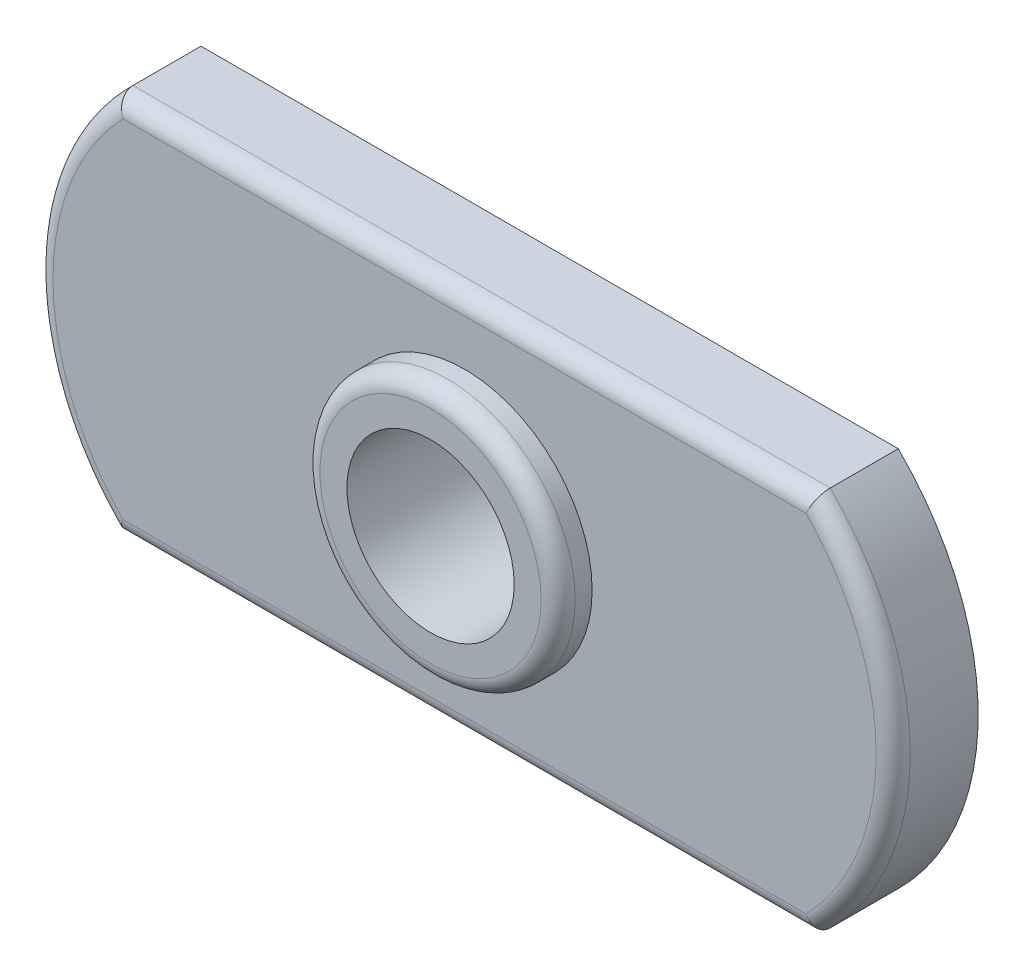
ISO-10303-21;
HEADER;
FILE_DESCRIPTION(('STEP AP214'),'2;1');
FILE_NAME('part.step','',(''),(''),'','','');
FILE_SCHEMA(('AUTOMOTIVE_DESIGN { 1 0 10303 214 1 1 1 1 }'));
ENDSEC;
DATA;
#1=APPLICATION_CONTEXT('core data for automotive mechanical design processes');
#2=APPLICATION_PROTOCOL_DEFINITION('international standard','automotive_design',2000,#1);
#3=PRODUCT_CONTEXT('',#1,'mechanical');
#4=PRODUCT('Part','Part','',(#3));
#5=PRODUCT_RELATED_PRODUCT_CATEGORY('part','',(#4));
#6=PRODUCT_DEFINITION_FORMATION('','',#4);
#7=PRODUCT_DEFINITION_CONTEXT('part definition',#1,'design');
#8=PRODUCT_DEFINITION('design','',#6,#7);
#9=PRODUCT_DEFINITION_SHAPE('','',#8);
#10=(LENGTH_UNIT() NAMED_UNIT(*) SI_UNIT(.MILLI.,.METRE.));
#11=(NAMED_UNIT(*) PLANE_ANGLE_UNIT() SI_UNIT($,.RADIAN.));
#12=(NAMED_UNIT(*) SI_UNIT($,.STERADIAN.) SOLID_ANGLE_UNIT());
#13=UNCERTAINTY_MEASURE_WITH_UNIT(LENGTH_MEASURE(1.E-05),#10,'distance_accuracy_value','');
#14=(GEOMETRIC_REPRESENTATION_CONTEXT(3) GLOBAL_UNCERTAINTY_ASSIGNED_CONTEXT((#13)) GLOBAL_UNIT_ASSIGNED_CONTEXT((#10,
#11,#12)) REPRESENTATION_CONTEXT('',''));
#15=CARTESIAN_POINT('',(0.,0.,0.));
#16=DIRECTION('',(0.,0.,1.));
#17=DIRECTION('',(1.,0.,0.));
#18=AXIS2_PLACEMENT_3D('',#15,#16,#17);
#19=CARTESIAN_POINT('',(-4.75265957446808,0.,2.5));
#20=DIRECTION('',(0.,0.,1.));
#21=DIRECTION('',(1.,0.,0.));
#22=AXIS2_PLACEMENT_3D('',#19,#20,#21);
#23=PLANE('',#22);
#24=DIRECTION('',(-1.,0.,0.));
#25=VECTOR('',#24,1.);
#26=CARTESIAN_POINT('',(-10.25,5.1,2.5));
#27=LINE('',#26,#25);
#28=CARTESIAN_POINT('',(10.0416492065865,5.09999999999999,2.5));
#29=VERTEX_POINT('',#28);
#30=CARTESIAN_POINT('',(-10.0416492065865,5.1,2.5));
#31=VERTEX_POINT('',#30);
#32=EDGE_CURVE('E139',#29,#31,#27,.T.);
#33=ORIENTED_EDGE('',*,*,#32,.T.);
#34=CARTESIAN_POINT('',(-4.75265957446808,0.,2.5));
#35=DIRECTION('',(0.,0.,1.));
#36=DIRECTION('',(1.,0.,0.));
#37=AXIS2_PLACEMENT_3D('',#34,#35,#36);
#38=CIRCLE('',#37,7.34734042553192);
#39=CARTESIAN_POINT('',(-10.0416492065865,-5.1,2.5));
#40=VERTEX_POINT('',#39);
#41=EDGE_CURVE('E141',#31,#40,#38,.T.);
#42=ORIENTED_EDGE('',*,*,#41,.T.);
#43=DIRECTION('',(1.,0.,0.));
#44=VECTOR('',#43,1.);
#45=CARTESIAN_POINT('',(10.25,-5.1,2.5));
#46=LINE('',#45,#44);
#47=CARTESIAN_POINT('',(10.0416492065865,-5.1,2.5));
#48=VERTEX_POINT('',#47);
#49=EDGE_CURVE('E108',#40,#48,#46,.T.);
#50=ORIENTED_EDGE('',*,*,#49,.T.);
#51=CARTESIAN_POINT('',(4.75265957446808,0.,2.5));
#52=DIRECTION('',(0.,0.,1.));
#53=DIRECTION('',(1.,0.,0.));
#54=AXIS2_PLACEMENT_3D('',#51,#52,#53);
#55=CIRCLE('',#54,7.34734042553192);
#56=EDGE_CURVE('E137',#48,#29,#55,.T.);
#57=ORIENTED_EDGE('',*,*,#56,.T.);
#58=EDGE_LOOP('',(#33,#42,#50,#57));
#59=FACE_BOUND('',#58,.T.);
#60=CARTESIAN_POINT('',(0.,0.,2.5));
#61=DIRECTION('',(0.,0.,1.));
#62=DIRECTION('',(1.,0.,0.));
#63=AXIS2_PLACEMENT_3D('',#60,#61,#62);
#64=CIRCLE('',#63,3.75);
#65=CARTESIAN_POINT('',(3.75,0.,2.5));
#66=VERTEX_POINT('',#65);
#67=EDGE_CURVE('E122',#66,#66,#64,.T.);
#68=ORIENTED_EDGE('',*,*,#67,.F.);
#69=EDGE_LOOP('',(#68));
#70=FACE_BOUND('',#69,.T.);
#71=ADVANCED_FACE('F37',(#59,#70),#23,.T.);
#72=CARTESIAN_POINT('',(-4.75265957446808,0.,2.5));
#73=DIRECTION('',(0.,0.,-1.));
#74=DIRECTION('',(-1.,0.,0.));
#75=AXIS2_PLACEMENT_3D('',#72,#73,#74);
#76=CYLINDRICAL_SURFACE('',#75,7.84734042553192);
#77=DIRECTION('',(0.,0.,-1.));
#78=VECTOR('',#77,1.);
#79=CARTESIAN_POINT('',(-10.25,-5.6,2.5));
#80=LINE('',#79,#78);
#81=CARTESIAN_POINT('',(-10.25,-5.6,2.));
#82=VERTEX_POINT('',#81);
#83=CARTESIAN_POINT('',(-10.25,-5.6,0.));
#84=VERTEX_POINT('',#83);
#85=EDGE_CURVE('E97',#82,#84,#80,.T.);
#86=ORIENTED_EDGE('',*,*,#85,.F.);
#87=CARTESIAN_POINT('',(-4.75265957446808,0.,2.));
#88=DIRECTION('',(0.,0.,1.));
#89=DIRECTION('',(1.,0.,0.));
#90=AXIS2_PLACEMENT_3D('',#87,#88,#89);
#91=CIRCLE('',#90,7.84734042553192);
#92=CARTESIAN_POINT('',(-10.25,5.6,2.));
#93=VERTEX_POINT('',#92);
#94=EDGE_CURVE('E144',#82,#93,#91,.F.);
#95=ORIENTED_EDGE('',*,*,#94,.T.);
#96=DIRECTION('',(0.,0.,-1.));
#97=VECTOR('',#96,1.);
#98=CARTESIAN_POINT('',(-10.25,5.6,2.5));
#99=LINE('',#98,#97);
#100=CARTESIAN_POINT('',(-10.25,5.6,0.));
#101=VERTEX_POINT('',#100);
#102=EDGE_CURVE('E120',#93,#101,#99,.T.);
#103=ORIENTED_EDGE('',*,*,#102,.T.);
#104=CARTESIAN_POINT('',(-4.75265957446808,0.,0.));
#105=DIRECTION('',(0.,0.,1.));
#106=DIRECTION('',(1.,0.,0.));
#107=AXIS2_PLACEMENT_3D('',#104,#105,#106);
#108=CIRCLE('',#107,7.84734042553192);
#109=EDGE_CURVE('E115',#101,#84,#108,.T.);
#110=ORIENTED_EDGE('',*,*,#109,.T.);
#111=EDGE_LOOP('',(#86,#95,#103,#110));
#112=FACE_BOUND('',#111,.T.);
#113=ADVANCED_FACE('F119',(#112),#76,.T.);
#114=CARTESIAN_POINT('',(-10.25,-5.6,2.5));
#115=DIRECTION('',(0.,1.,0.));
#116=DIRECTION('',(-1.,0.,0.));
#117=AXIS2_PLACEMENT_3D('',#114,#115,#116);
#118=PLANE('',#117);
#119=DIRECTION('',(0.,0.,-1.));
#120=VECTOR('',#119,1.);
#121=CARTESIAN_POINT('',(10.25,-5.6,2.5));
#122=LINE('',#121,#120);
#123=CARTESIAN_POINT('',(10.25,-5.6,2.));
#124=VERTEX_POINT('',#123);
#125=CARTESIAN_POINT('',(10.25,-5.6,0.));
#126=VERTEX_POINT('',#125);
#127=EDGE_CURVE('E109',#124,#126,#122,.T.);
#128=ORIENTED_EDGE('',*,*,#127,.F.);
#129=DIRECTION('',(1.,0.,0.));
#130=VECTOR('',#129,1.);
#131=CARTESIAN_POINT('',(-10.25,-5.6,2.));
#132=LINE('',#131,#130);
#133=EDGE_CURVE('E103',#124,#82,#132,.F.);
#134=ORIENTED_EDGE('',*,*,#133,.T.);
#135=ORIENTED_EDGE('',*,*,#85,.T.);
#136=DIRECTION('',(1.,0.,0.));
#137=VECTOR('',#136,1.);
#138=CARTESIAN_POINT('',(-10.25,-5.6,0.));
#139=LINE('',#138,#137);
#140=EDGE_CURVE('E100',#84,#126,#139,.T.);
#141=ORIENTED_EDGE('',*,*,#140,.T.);
#142=EDGE_LOOP('',(#128,#134,#135,#141));
#143=FACE_BOUND('',#142,.T.);
#144=ADVANCED_FACE('F99',(#143),#118,.F.);
#145=CARTESIAN_POINT('',(4.75265957446808,0.,2.5));
#146=DIRECTION('',(0.,0.,-1.));
#147=DIRECTION('',(-1.,0.,0.));
#148=AXIS2_PLACEMENT_3D('',#145,#146,#147);
#149=CYLINDRICAL_SURFACE('',#148,7.84734042553192);
#150=DIRECTION('',(0.,0.,-1.));
#151=VECTOR('',#150,1.);
#152=CARTESIAN_POINT('',(10.25,5.6,2.5));
#153=LINE('',#152,#151);
#154=CARTESIAN_POINT('',(10.25,5.6,2.));
#155=VERTEX_POINT('',#154);
#156=CARTESIAN_POINT('',(10.25,5.6,0.));
#157=VERTEX_POINT('',#156);
#158=EDGE_CURVE('E133',#155,#157,#153,.T.);
#159=ORIENTED_EDGE('',*,*,#158,.F.);
#160=CARTESIAN_POINT('',(4.75265957446808,0.,2.));
#161=DIRECTION('',(0.,0.,1.));
#162=DIRECTION('',(1.,0.,0.));
#163=AXIS2_PLACEMENT_3D('',#160,#161,#162);
#164=CIRCLE('',#163,7.84734042553192);
#165=EDGE_CURVE('E58',#155,#124,#164,.F.);
#166=ORIENTED_EDGE('',*,*,#165,.T.);
#167=ORIENTED_EDGE('',*,*,#127,.T.);
#168=CARTESIAN_POINT('',(4.75265957446808,0.,0.));
#169=DIRECTION('',(0.,0.,1.));
#170=DIRECTION('',(1.,0.,0.));
#171=AXIS2_PLACEMENT_3D('',#168,#169,#170);
#172=CIRCLE('',#171,7.84734042553192);
#173=EDGE_CURVE('E117',#126,#157,#172,.T.);
#174=ORIENTED_EDGE('',*,*,#173,.T.);
#175=EDGE_LOOP('',(#159,#166,#167,#174));
#176=FACE_BOUND('',#175,.T.);
#177=ADVANCED_FACE('F209',(#176),#149,.T.);
#178=CARTESIAN_POINT('',(10.25,5.6,2.5));
#179=DIRECTION('',(0.,-1.,0.));
#180=DIRECTION('',(1.,0.,0.));
#181=AXIS2_PLACEMENT_3D('',#178,#179,#180);
#182=PLANE('',#181);
#183=ORIENTED_EDGE('',*,*,#102,.F.);
#184=DIRECTION('',(-1.,0.,0.));
#185=VECTOR('',#184,1.);
#186=CARTESIAN_POINT('',(10.25,5.6,2.));
#187=LINE('',#186,#185);
#188=EDGE_CURVE('E66',#93,#155,#187,.F.);
#189=ORIENTED_EDGE('',*,*,#188,.T.);
#190=ORIENTED_EDGE('',*,*,#158,.T.);
#191=DIRECTION('',(-1.,0.,0.));
#192=VECTOR('',#191,1.);
#193=CARTESIAN_POINT('',(10.25,5.6,0.));
#194=LINE('',#193,#192);
#195=EDGE_CURVE('E130',#157,#101,#194,.T.);
#196=ORIENTED_EDGE('',*,*,#195,.T.);
#197=EDGE_LOOP('',(#183,#189,#190,#196));
#198=FACE_BOUND('',#197,.T.);
#199=ADVANCED_FACE('F205',(#198),#182,.F.);
#200=CARTESIAN_POINT('',(-4.75265957446808,0.,0.));
#201=DIRECTION('',(0.,0.,1.));
#202=DIRECTION('',(1.,0.,0.));
#203=AXIS2_PLACEMENT_3D('',#200,#201,#202);
#204=PLANE('',#203);
#205=CARTESIAN_POINT('',(0.,0.,0.));
#206=DIRECTION('',(0.,0.,1.));
#207=DIRECTION('',(1.,0.,0.));
#208=AXIS2_PLACEMENT_3D('',#205,#206,#207);
#209=CIRCLE('',#208,2.45850000000001);
#210=CARTESIAN_POINT('',(2.45850000000001,0.,0.));
#211=VERTEX_POINT('',#210);
#212=EDGE_CURVE('E125',#211,#211,#209,.T.);
#213=ORIENTED_EDGE('',*,*,#212,.T.);
#214=EDGE_LOOP('',(#213));
#215=FACE_BOUND('',#214,.T.);
#216=ORIENTED_EDGE('',*,*,#109,.F.);
#217=ORIENTED_EDGE('',*,*,#195,.F.);
#218=ORIENTED_EDGE('',*,*,#173,.F.);
#219=ORIENTED_EDGE('',*,*,#140,.F.);
#220=EDGE_LOOP('',(#216,#217,#218,#219));
#221=FACE_BOUND('',#220,.T.);
#222=ADVANCED_FACE('F113',(#215,#221),#204,.F.);
#223=CARTESIAN_POINT('',(0.,0.,3.5));
#224=DIRECTION('',(0.,0.,-1.));
#225=DIRECTION('',(-1.,0.,0.));
#226=AXIS2_PLACEMENT_3D('',#223,#224,#225);
#227=CYLINDRICAL_SURFACE('',#226,3.75);
#228=CARTESIAN_POINT('',(0.,0.,3.));
#229=DIRECTION('',(0.,0.,1.));
#230=DIRECTION('',(1.,0.,0.));
#231=AXIS2_PLACEMENT_3D('',#228,#229,#230);
#232=CIRCLE('',#231,3.75);
#233=CARTESIAN_POINT('',(3.75,0.,3.));
#234=VERTEX_POINT('',#233);
#235=EDGE_CURVE('E11',#234,#234,#232,.F.);
#236=ORIENTED_EDGE('',*,*,#235,.T.);
#237=EDGE_LOOP('',(#236));
#238=FACE_BOUND('',#237,.T.);
#239=ORIENTED_EDGE('',*,*,#67,.T.);
#240=EDGE_LOOP('',(#239));
#241=FACE_BOUND('',#240,.T.);
#242=ADVANCED_FACE('F201',(#238,#241),#227,.T.);
#243=CARTESIAN_POINT('',(0.,0.,3.5));
#244=DIRECTION('',(0.,0.,1.));
#245=DIRECTION('',(1.,0.,0.));
#246=AXIS2_PLACEMENT_3D('',#243,#244,#245);
#247=PLANE('',#246);
#248=CARTESIAN_POINT('',(0.,0.,3.5));
#249=DIRECTION('',(0.,0.,1.));
#250=DIRECTION('',(1.,0.,0.));
#251=AXIS2_PLACEMENT_3D('',#248,#249,#250);
#252=CIRCLE('',#251,3.25);
#253=CARTESIAN_POINT('',(3.25,0.,3.5));
#254=VERTEX_POINT('',#253);
#255=EDGE_CURVE('E50',#254,#254,#252,.T.);
#256=ORIENTED_EDGE('',*,*,#255,.T.);
#257=EDGE_LOOP('',(#256));
#258=FACE_BOUND('',#257,.T.);
#259=CARTESIAN_POINT('',(0.,0.,3.5));
#260=DIRECTION('',(0.,0.,1.));
#261=DIRECTION('',(1.,0.,0.));
#262=AXIS2_PLACEMENT_3D('',#259,#260,#261);
#263=CIRCLE('',#262,2.45850000000001);
#264=CARTESIAN_POINT('',(2.45850000000001,0.,3.5));
#265=VERTEX_POINT('',#264);
#266=EDGE_CURVE('E311',#265,#265,#263,.T.);
#267=ORIENTED_EDGE('',*,*,#266,.F.);
#268=EDGE_LOOP('',(#267));
#269=FACE_BOUND('',#268,.T.);
#270=ADVANCED_FACE('F188',(#258,#269),#247,.T.);
#271=CARTESIAN_POINT('',(0.,0.,3.5));
#272=DIRECTION('',(0.,0.,1.));
#273=DIRECTION('',(1.,0.,0.));
#274=AXIS2_PLACEMENT_3D('',#271,#272,#273);
#275=CYLINDRICAL_SURFACE('',#274,2.45850000000001);
#276=ORIENTED_EDGE('',*,*,#212,.F.);
#277=EDGE_LOOP('',(#276));
#278=FACE_BOUND('',#277,.T.);
#279=ORIENTED_EDGE('',*,*,#266,.T.);
#280=EDGE_LOOP('',(#279));
#281=FACE_BOUND('',#280,.T.);
#282=ADVANCED_FACE('F180',(#278,#281),#275,.F.);
#283=CARTESIAN_POINT('',(4.75265957446808,0.,2.));
#284=DIRECTION('',(0.,0.,1.));
#285=DIRECTION('',(1.,0.,0.));
#286=AXIS2_PLACEMENT_3D('',#283,#284,#285);
#287=TOROIDAL_SURFACE('',#286,7.34734042553192,0.5);
#288=CARTESIAN_POINT('',(10.25,-5.6,2.));
#289=CARTESIAN_POINT('',(10.250011402791,-5.60002984456552,2.0266115029985));
#290=CARTESIAN_POINT('',(10.2491323230388,-5.59787754354878,2.05320410315333));
#291=CARTESIAN_POINT('',(10.2456826291113,-5.5894420215127,2.10554137407861));
#292=CARTESIAN_POINT('',(10.2431166303748,-5.58317007196215,2.13128815777437));
#293=CARTESIAN_POINT('',(10.2363824451846,-5.56672826674952,2.18127086868435));
#294=CARTESIAN_POINT('',(10.2322146337897,-5.55655932355669,2.20550714803526));
#295=CARTESIAN_POINT('',(10.2224260199008,-5.53271361496976,2.25186976520071));
#296=CARTESIAN_POINT('',(10.2168047118143,-5.51903562898359,2.27399536515132));
#297=CARTESIAN_POINT('',(10.2041004813723,-5.48818223477534,2.31625875487421));
#298=CARTESIAN_POINT('',(10.1969788729479,-5.47091445972466,2.33631730122969));
#299=CARTESIAN_POINT('',(10.1815981164705,-5.43370628653791,2.37326680529309));
#300=CARTESIAN_POINT('',(10.1733386020651,-5.41376502772066,2.39015673870281));
#301=CARTESIAN_POINT('',(10.1552867876469,-5.37029338260402,2.42155695040794));
#302=CARTESIAN_POINT('',(10.1454274573574,-5.34660903206974,2.43581524720428));
#303=CARTESIAN_POINT('',(10.1249214951466,-5.29749606565613,2.46015945235529));
#304=CARTESIAN_POINT('',(10.1142746021899,-5.27206687165739,2.47024396995244));
#305=CARTESIAN_POINT('',(10.0937092563895,-5.22310259202681,2.48520589127507));
#306=CARTESIAN_POINT('',(10.0838466233048,-5.19968319303782,2.49054669221443));
#307=CARTESIAN_POINT('',(10.0638987840409,-5.15245122932119,2.49781312217656));
#308=CARTESIAN_POINT('',(10.0538140501624,-5.12863952176762,2.4997454006235));
#309=CARTESIAN_POINT('',(10.0430232792986,-5.10323411585027,2.49999217263718));
#310=CARTESIAN_POINT('',(10.0423362711842,-5.10161696539383,2.5000000185035));
#311=CARTESIAN_POINT('',(10.0416492065864,-5.1,2.5));
#312=B_SPLINE_CURVE_WITH_KNOTS('',3,(#288,#289,#290,#291,#292,#293,#294,#295,#296,#297,#298,
#299,#300,#301,#302,#303,#304,#305,#306,#307,#308,#309,#310,#311),.UNSPECIFIED.,.F.,.F.,(4,2,2,
2,2,2,2,2,2,2,2,4),(0.,0.0797038566524749,0.159190544737728,0.238658632615913,0.318154400391605,
0.400027749102196,0.481927519076945,0.569605842672987,0.657313358351373,0.734996715675133,
0.812528358218248,0.817799419336087),.UNSPECIFIED.);
#313=EDGE_CURVE('E172',#124,#48,#312,.T.);
#314=ORIENTED_EDGE('',*,*,#313,.F.);
#315=ORIENTED_EDGE('',*,*,#165,.F.);
#316=CARTESIAN_POINT('',(10.25,5.6,2.));
#317=CARTESIAN_POINT('',(10.250011402791,5.60002984456552,2.0266115029985));
#318=CARTESIAN_POINT('',(10.2491323230388,5.59787754354878,2.05320410315333));
#319=CARTESIAN_POINT('',(10.2456826291113,5.5894420215127,2.10554137407861));
#320=CARTESIAN_POINT('',(10.2431166303748,5.58317007196215,2.13128815777437));
#321=CARTESIAN_POINT('',(10.2363824451846,5.56672826674951,2.18127086868435));
#322=CARTESIAN_POINT('',(10.2322146337898,5.55655932355669,2.20550714803526));
#323=CARTESIAN_POINT('',(10.2224260199008,5.53271361496975,2.25186976520071));
#324=CARTESIAN_POINT('',(10.2168047118144,5.51903562898358,2.27399536515132));
#325=CARTESIAN_POINT('',(10.2041004813723,5.48818223477533,2.31625875487421));
#326=CARTESIAN_POINT('',(10.1969788729479,5.47091445972466,2.33631730122969));
#327=CARTESIAN_POINT('',(10.1815981164705,5.43370628653791,2.37326680529309));
#328=CARTESIAN_POINT('',(10.1733386020651,5.41376502772066,2.39015673870281));
#329=CARTESIAN_POINT('',(10.1552867876469,5.37029338260402,2.42155695040794));
#330=CARTESIAN_POINT('',(10.1454274573574,5.34660903206973,2.43581524720428));
#331=CARTESIAN_POINT('',(10.1249214951466,5.29749606565613,2.46015945235529));
#332=CARTESIAN_POINT('',(10.1142746021899,5.27206687165739,2.47024396995244));
#333=CARTESIAN_POINT('',(10.0937092563895,5.2231025920268,2.48520589127507));
#334=CARTESIAN_POINT('',(10.0838466233048,5.19968319303782,2.49054669221443));
#335=CARTESIAN_POINT('',(10.0638987840409,5.15245122932119,2.49781312217656));
#336=CARTESIAN_POINT('',(10.0538140501624,5.12863952176761,2.4997454006235));
#337=CARTESIAN_POINT('',(10.0430232792986,5.10323411585026,2.49999217263718));
#338=CARTESIAN_POINT('',(10.0423362711842,5.10161696539383,2.5000000185035));
#339=CARTESIAN_POINT('',(10.0416492065864,5.1,2.5));
#340=B_SPLINE_CURVE_WITH_KNOTS('',3,(#316,#317,#318,#319,#320,#321,#322,#323,#324,#325,#326,
#327,#328,#329,#330,#331,#332,#333,#334,#335,#336,#337,#338,#339),.UNSPECIFIED.,.F.,.F.,(4,2,2,
2,2,2,2,2,2,2,2,4),(0.,0.0797038566524743,0.159190544737727,0.238658632615913,0.318154400391605,
0.400027749102196,0.481927519076945,0.569605842672987,0.657313358351372,0.734996715675132,
0.812528358218248,0.817799419336088),.UNSPECIFIED.);
#341=EDGE_CURVE('E41',#29,#155,#340,.F.);
#342=ORIENTED_EDGE('',*,*,#341,.F.);
#343=ORIENTED_EDGE('',*,*,#56,.F.);
#344=EDGE_LOOP('',(#314,#315,#342,#343));
#345=FACE_BOUND('',#344,.T.);
#346=ADVANCED_FACE('F177',(#345),#287,.T.);
#347=CARTESIAN_POINT('',(-4.75265957446808,5.1,2.));
#348=DIRECTION('',(1.,0.,0.));
#349=DIRECTION('',(0.,1.,0.));
#350=AXIS2_PLACEMENT_3D('',#347,#348,#349);
#351=CYLINDRICAL_SURFACE('',#350,0.5);
#352=ORIENTED_EDGE('',*,*,#341,.T.);
#353=ORIENTED_EDGE('',*,*,#188,.F.);
#354=CARTESIAN_POINT('',(-10.25,5.6,2.));
#355=CARTESIAN_POINT('',(-10.250011402791,5.60002984456552,2.0266115029985));
#356=CARTESIAN_POINT('',(-10.2491323230388,5.59787754354878,2.05320410315333));
#357=CARTESIAN_POINT('',(-10.2456826291113,5.5894420215127,2.10554137407861));
#358=CARTESIAN_POINT('',(-10.2431166303748,5.58317007196216,2.13128815777437));
#359=CARTESIAN_POINT('',(-10.2363824451846,5.56672826674952,2.18127086868435));
#360=CARTESIAN_POINT('',(-10.2322146337897,5.5565593235567,2.20550714803526));
#361=CARTESIAN_POINT('',(-10.2224260199008,5.53271361496976,2.25186976520071));
#362=CARTESIAN_POINT('',(-10.2168047118143,5.51903562898359,2.27399536515132));
#363=CARTESIAN_POINT('',(-10.2041004813723,5.48818223477534,2.31625875487421));
#364=CARTESIAN_POINT('',(-10.1969788729479,5.47091445972467,2.33631730122969));
#365=CARTESIAN_POINT('',(-10.1815981164705,5.43370628653791,2.37326680529309));
#366=CARTESIAN_POINT('',(-10.1733386020651,5.41376502772066,2.39015673870281));
#367=CARTESIAN_POINT('',(-10.1552867876469,5.37029338260402,2.42155695040794));
#368=CARTESIAN_POINT('',(-10.1454274573574,5.34660903206974,2.43581524720428));
#369=CARTESIAN_POINT('',(-10.1249214951466,5.29749606565613,2.46015945235529));
#370=CARTESIAN_POINT('',(-10.1142746021899,5.2720668716574,2.47024396995244));
#371=CARTESIAN_POINT('',(-10.0937092563895,5.22310259202681,2.48520589127507));
#372=CARTESIAN_POINT('',(-10.0838466233048,5.19968319303783,2.49054669221443));
#373=CARTESIAN_POINT('',(-10.0638987840409,5.15245122932119,2.49781312217656));
#374=CARTESIAN_POINT('',(-10.0538140501624,5.1286395217676,2.4997454006235));
#375=CARTESIAN_POINT('',(-10.0430232792986,5.10323411585027,2.49999217263718));
#376=CARTESIAN_POINT('',(-10.0423362711842,5.10161696539383,2.5000000185035));
#377=CARTESIAN_POINT('',(-10.0416492065864,5.1,2.5));
#378=B_SPLINE_CURVE_WITH_KNOTS('',3,(#354,#355,#356,#357,#358,#359,#360,#361,#362,#363,#364,
#365,#366,#367,#368,#369,#370,#371,#372,#373,#374,#375,#376,#377),.UNSPECIFIED.,.F.,.F.,(4,2,2,
2,2,2,2,2,2,2,2,4),(0.,0.0797038566524743,0.159190544737727,0.238658632615913,0.318154400391604,
0.400027749102196,0.481927519076944,0.569605842672988,0.657313358351371,0.734996715675131,
0.812528358218247,0.817799419336087),.UNSPECIFIED.);
#379=EDGE_CURVE('E158',#31,#93,#378,.F.);
#380=ORIENTED_EDGE('',*,*,#379,.F.);
#381=ORIENTED_EDGE('',*,*,#32,.F.);
#382=EDGE_LOOP('',(#352,#353,#380,#381));
#383=FACE_BOUND('',#382,.T.);
#384=ADVANCED_FACE('F168',(#383),#351,.T.);
#385=CARTESIAN_POINT('',(-4.75265957446808,-5.1,2.));
#386=DIRECTION('',(-1.,0.,0.));
#387=DIRECTION('',(0.,-1.,0.));
#388=AXIS2_PLACEMENT_3D('',#385,#386,#387);
#389=CYLINDRICAL_SURFACE('',#388,0.5);
#390=ORIENTED_EDGE('',*,*,#313,.T.);
#391=ORIENTED_EDGE('',*,*,#49,.F.);
#392=CARTESIAN_POINT('',(-10.25,-5.6,2.));
#393=CARTESIAN_POINT('',(-10.250011402791,-5.60002984456552,2.0266115029985));
#394=CARTESIAN_POINT('',(-10.2491323230388,-5.59787754354878,2.05320410315333));
#395=CARTESIAN_POINT('',(-10.2456826291113,-5.5894420215127,2.10554137407861));
#396=CARTESIAN_POINT('',(-10.2431166303748,-5.58317007196215,2.13128815777437));
#397=CARTESIAN_POINT('',(-10.2363824451846,-5.56672826674951,2.18127086868435));
#398=CARTESIAN_POINT('',(-10.2322146337897,-5.55655932355669,2.20550714803526));
#399=CARTESIAN_POINT('',(-10.2224260199008,-5.53271361496975,2.25186976520071));
#400=CARTESIAN_POINT('',(-10.2168047118143,-5.51903562898358,2.27399536515132));
#401=CARTESIAN_POINT('',(-10.2041004813723,-5.48818223477533,2.31625875487421));
#402=CARTESIAN_POINT('',(-10.1969788729479,-5.47091445972466,2.33631730122969));
#403=CARTESIAN_POINT('',(-10.1815981164705,-5.4337062865379,2.37326680529309));
#404=CARTESIAN_POINT('',(-10.1733386020651,-5.41376502772066,2.39015673870281));
#405=CARTESIAN_POINT('',(-10.1552867876469,-5.37029338260402,2.42155695040794));
#406=CARTESIAN_POINT('',(-10.1454274573574,-5.34660903206974,2.43581524720428));
#407=CARTESIAN_POINT('',(-10.1249214951466,-5.29749606565613,2.46015945235529));
#408=CARTESIAN_POINT('',(-10.1142746021899,-5.27206687165739,2.47024396995244));
#409=CARTESIAN_POINT('',(-10.0937092563895,-5.2231025920268,2.48520589127507));
#410=CARTESIAN_POINT('',(-10.0838466233048,-5.19968319303782,2.49054669221443));
#411=CARTESIAN_POINT('',(-10.0638987840409,-5.15245122932119,2.49781312217656));
#412=CARTESIAN_POINT('',(-10.0538140501624,-5.12863952176761,2.4997454006235));
#413=CARTESIAN_POINT('',(-10.0430232792986,-5.10323411585026,2.49999217263718));
#414=CARTESIAN_POINT('',(-10.0423362711842,-5.10161696539383,2.5000000185035));
#415=CARTESIAN_POINT('',(-10.0416492065864,-5.1,2.5));
#416=B_SPLINE_CURVE_WITH_KNOTS('',3,(#392,#393,#394,#395,#396,#397,#398,#399,#400,#401,#402,
#403,#404,#405,#406,#407,#408,#409,#410,#411,#412,#413,#414,#415),.UNSPECIFIED.,.F.,.F.,(4,2,2,
2,2,2,2,2,2,2,2,4),(0.,0.0797038566524744,0.159190544737727,0.238658632615914,0.318154400391605,
0.400027749102196,0.481927519076945,0.569605842672988,0.657313358351371,0.734996715675131,
0.812528358218246,0.817799419336086),.UNSPECIFIED.);
#417=EDGE_CURVE('E151',#82,#40,#416,.T.);
#418=ORIENTED_EDGE('',*,*,#417,.F.);
#419=ORIENTED_EDGE('',*,*,#133,.F.);
#420=EDGE_LOOP('',(#390,#391,#418,#419));
#421=FACE_BOUND('',#420,.T.);
#422=ADVANCED_FACE('F165',(#421),#389,.T.);
#423=CARTESIAN_POINT('',(-4.75265957446808,0.,2.));
#424=DIRECTION('',(0.,0.,1.));
#425=DIRECTION('',(1.,0.,0.));
#426=AXIS2_PLACEMENT_3D('',#423,#424,#425);
#427=TOROIDAL_SURFACE('',#426,7.34734042553192,0.5);
#428=ORIENTED_EDGE('',*,*,#379,.T.);
#429=ORIENTED_EDGE('',*,*,#94,.F.);
#430=ORIENTED_EDGE('',*,*,#417,.T.);
#431=ORIENTED_EDGE('',*,*,#41,.F.);
#432=EDGE_LOOP('',(#428,#429,#430,#431));
#433=FACE_BOUND('',#432,.T.);
#434=ADVANCED_FACE('F162',(#433),#427,.T.);
#435=CARTESIAN_POINT('',(0.,0.,3.));
#436=DIRECTION('',(0.,0.,1.));
#437=DIRECTION('',(1.,0.,0.));
#438=AXIS2_PLACEMENT_3D('',#435,#436,#437);
#439=TOROIDAL_SURFACE('',#438,3.25,0.5);
#440=ORIENTED_EDGE('',*,*,#235,.F.);
#441=EDGE_LOOP('',(#440));
#442=FACE_BOUND('',#441,.T.);
#443=ORIENTED_EDGE('',*,*,#255,.F.);
#444=EDGE_LOOP('',(#443));
#445=FACE_BOUND('',#444,.T.);
#446=ADVANCED_FACE('F39',(#442,#445),#439,.T.);
#447=CLOSED_SHELL('',(#71,#113,#144,#177,#199,#222,#242,#270,#282,#346,#384,#422,#434,#446));
#448=MANIFOLD_SOLID_BREP('B2',#447);
#449=ADVANCED_BREP_SHAPE_REPRESENTATION('',(#18,#448),#14);
#450=SHAPE_DEFINITION_REPRESENTATION(#9,#449);
ENDSEC;
END-ISO-10303-21;
